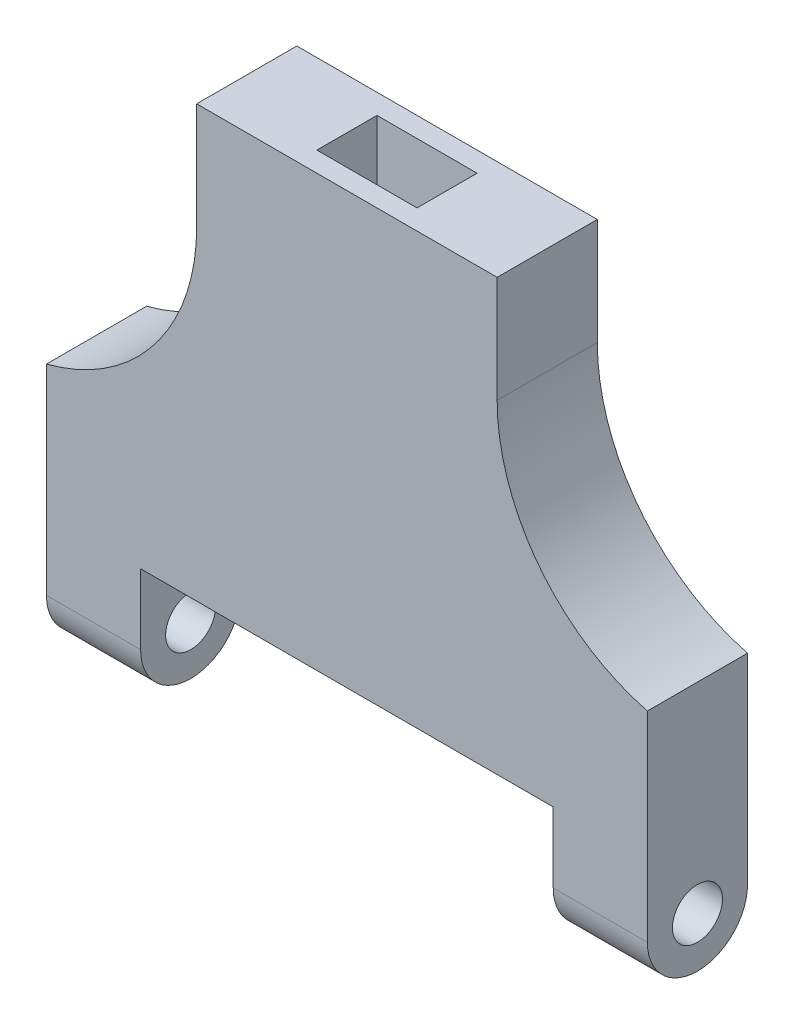
ISO-10303-21;
HEADER;
FILE_DESCRIPTION(('STEP AP214'),'2;1');
FILE_NAME('part.step','',(''),(''),'','','');
FILE_SCHEMA(('AUTOMOTIVE_DESIGN { 1 0 10303 214 1 1 1 1 }'));
ENDSEC;
DATA;
#1=APPLICATION_CONTEXT('core data for automotive mechanical design processes');
#2=APPLICATION_PROTOCOL_DEFINITION('international standard','automotive_design',2000,#1);
#3=PRODUCT_CONTEXT('',#1,'mechanical');
#4=PRODUCT('Part','Part','',(#3));
#5=PRODUCT_RELATED_PRODUCT_CATEGORY('part','',(#4));
#6=PRODUCT_DEFINITION_FORMATION('','',#4);
#7=PRODUCT_DEFINITION_CONTEXT('part definition',#1,'design');
#8=PRODUCT_DEFINITION('design','',#6,#7);
#9=PRODUCT_DEFINITION_SHAPE('','',#8);
#10=(LENGTH_UNIT() NAMED_UNIT(*) SI_UNIT(.MILLI.,.METRE.));
#11=(NAMED_UNIT(*) PLANE_ANGLE_UNIT() SI_UNIT($,.RADIAN.));
#12=(NAMED_UNIT(*) SI_UNIT($,.STERADIAN.) SOLID_ANGLE_UNIT());
#13=UNCERTAINTY_MEASURE_WITH_UNIT(LENGTH_MEASURE(1.E-05),#10,'distance_accuracy_value','');
#14=(GEOMETRIC_REPRESENTATION_CONTEXT(3) GLOBAL_UNCERTAINTY_ASSIGNED_CONTEXT((#13)) GLOBAL_UNIT_ASSIGNED_CONTEXT((#10,
#11,#12)) REPRESENTATION_CONTEXT('',''));
#15=CARTESIAN_POINT('',(0.,0.,0.));
#16=DIRECTION('',(0.,0.,1.));
#17=DIRECTION('',(1.,0.,0.));
#18=AXIS2_PLACEMENT_3D('',#15,#16,#17);
#19=CARTESIAN_POINT('',(-7.07106781186548,60.,2.5));
#20=DIRECTION('',(1.,0.,0.));
#21=DIRECTION('',(0.,0.,-1.));
#22=AXIS2_PLACEMENT_3D('',#19,#20,#21);
#23=CYLINDRICAL_SURFACE('',#22,1.25);
#24=CARTESIAN_POINT('',(0.,60.,2.5));
#25=DIRECTION('',(-1.,0.,0.));
#26=DIRECTION('',(0.,0.,1.));
#27=AXIS2_PLACEMENT_3D('',#24,#25,#26);
#28=CIRCLE('',#27,1.25);
#29=CARTESIAN_POINT('',(0.,60.,3.75));
#30=VERTEX_POINT('',#29);
#31=EDGE_CURVE('E203',#30,#30,#28,.F.);
#32=ORIENTED_EDGE('',*,*,#31,.T.);
#33=EDGE_LOOP('',(#32));
#34=FACE_BOUND('',#33,.T.);
#35=CARTESIAN_POINT('',(-4.7,60.,2.5));
#36=DIRECTION('',(1.,0.,0.));
#37=DIRECTION('',(0.,1.,0.));
#38=AXIS2_PLACEMENT_3D('',#35,#36,#37);
#39=CIRCLE('',#38,1.25);
#40=CARTESIAN_POINT('',(-4.7,61.25,2.5));
#41=VERTEX_POINT('',#40);
#42=EDGE_CURVE('E233',#41,#41,#39,.F.);
#43=ORIENTED_EDGE('',*,*,#42,.T.);
#44=EDGE_LOOP('',(#43));
#45=FACE_BOUND('',#44,.T.);
#46=ADVANCED_FACE('F33',(#34,#45),#23,.F.);
#47=CARTESIAN_POINT('',(-30.,60.,2.5));
#48=DIRECTION('',(1.,0.,0.));
#49=DIRECTION('',(0.,0.,-1.));
#50=AXIS2_PLACEMENT_3D('',#47,#48,#49);
#51=CYLINDRICAL_SURFACE('',#50,2.5);
#52=DIRECTION('',(1.,0.,0.));
#53=VECTOR('',#52,1.);
#54=CARTESIAN_POINT('',(-30.,60.,5.));
#55=LINE('',#54,#53);
#56=CARTESIAN_POINT('',(-4.7,60.,5.));
#57=VERTEX_POINT('',#56);
#58=CARTESIAN_POINT('',(0.,60.,5.));
#59=VERTEX_POINT('',#58);
#60=EDGE_CURVE('E264',#57,#59,#55,.T.);
#61=ORIENTED_EDGE('',*,*,#60,.F.);
#62=CARTESIAN_POINT('',(-4.7,60.,2.5));
#63=DIRECTION('',(1.,0.,0.));
#64=DIRECTION('',(0.,1.,0.));
#65=AXIS2_PLACEMENT_3D('',#62,#63,#64);
#66=CIRCLE('',#65,2.5);
#67=CARTESIAN_POINT('',(-4.7,60.,0.));
#68=VERTEX_POINT('',#67);
#69=EDGE_CURVE('E230',#57,#68,#66,.T.);
#70=ORIENTED_EDGE('',*,*,#69,.T.);
#71=DIRECTION('',(1.,0.,0.));
#72=VECTOR('',#71,1.);
#73=CARTESIAN_POINT('',(-30.,60.,0.));
#74=LINE('',#73,#72);
#75=CARTESIAN_POINT('',(0.,60.,0.));
#76=VERTEX_POINT('',#75);
#77=EDGE_CURVE('E252',#68,#76,#74,.T.);
#78=ORIENTED_EDGE('',*,*,#77,.T.);
#79=CARTESIAN_POINT('',(0.,60.,2.5));
#80=DIRECTION('',(-1.,0.,0.));
#81=DIRECTION('',(0.,0.,1.));
#82=AXIS2_PLACEMENT_3D('',#79,#80,#81);
#83=CIRCLE('',#82,2.5);
#84=EDGE_CURVE('E239',#76,#59,#83,.T.);
#85=ORIENTED_EDGE('',*,*,#84,.T.);
#86=EDGE_LOOP('',(#61,#70,#78,#85));
#87=FACE_BOUND('',#86,.T.);
#88=ADVANCED_FACE('F334',(#87),#51,.T.);
#89=CARTESIAN_POINT('',(-25.3,60.,2.5));
#90=DIRECTION('',(-1.,0.,0.));
#91=DIRECTION('',(0.,-1.,0.));
#92=AXIS2_PLACEMENT_3D('',#89,#90,#91);
#93=CIRCLE('',#92,1.25);
#94=CARTESIAN_POINT('',(-25.3,58.75,2.5));
#95=VERTEX_POINT('',#94);
#96=EDGE_CURVE('E221',#95,#95,#93,.F.);
#97=ORIENTED_EDGE('',*,*,#96,.T.);
#98=EDGE_LOOP('',(#97));
#99=FACE_BOUND('',#98,.T.);
#100=CARTESIAN_POINT('',(-30.,60.,2.5));
#101=DIRECTION('',(-1.,0.,0.));
#102=DIRECTION('',(0.,0.,1.));
#103=AXIS2_PLACEMENT_3D('',#100,#101,#102);
#104=CIRCLE('',#103,1.25);
#105=CARTESIAN_POINT('',(-30.,60.,3.75));
#106=VERTEX_POINT('',#105);
#107=EDGE_CURVE('E236',#106,#106,#104,.T.);
#108=ORIENTED_EDGE('',*,*,#107,.T.);
#109=EDGE_LOOP('',(#108));
#110=FACE_BOUND('',#109,.T.);
#111=ADVANCED_FACE('F336',(#99,#110),#23,.F.);
#112=CARTESIAN_POINT('',(0.,60.,2.5));
#113=DIRECTION('',(-1.,0.,0.));
#114=DIRECTION('',(0.,0.,1.));
#115=AXIS2_PLACEMENT_3D('',#112,#113,#114);
#116=PLANE('',#115);
#117=DIRECTION('',(0.,1.,0.));
#118=VECTOR('',#117,1.);
#119=CARTESIAN_POINT('',(0.,60.,5.));
#120=LINE('',#119,#118);
#121=CARTESIAN_POINT('',(0.,70.,5.));
#122=VERTEX_POINT('',#121);
#123=EDGE_CURVE('E255',#59,#122,#120,.T.);
#124=ORIENTED_EDGE('',*,*,#123,.F.);
#125=ORIENTED_EDGE('',*,*,#84,.F.);
#126=DIRECTION('',(0.,-1.,0.));
#127=VECTOR('',#126,1.);
#128=CARTESIAN_POINT('',(0.,60.,0.));
#129=LINE('',#128,#127);
#130=CARTESIAN_POINT('',(0.,70.,0.));
#131=VERTEX_POINT('',#130);
#132=EDGE_CURVE('E244',#131,#76,#129,.T.);
#133=ORIENTED_EDGE('',*,*,#132,.F.);
#134=DIRECTION('',(0.,0.,-1.));
#135=VECTOR('',#134,1.);
#136=CARTESIAN_POINT('',(0.,70.,5.));
#137=LINE('',#136,#135);
#138=EDGE_CURVE('E257',#122,#131,#137,.T.);
#139=ORIENTED_EDGE('',*,*,#138,.F.);
#140=EDGE_LOOP('',(#124,#125,#133,#139));
#141=FACE_BOUND('',#140,.T.);
#142=ORIENTED_EDGE('',*,*,#31,.F.);
#143=EDGE_LOOP('',(#142));
#144=FACE_BOUND('',#143,.T.);
#145=ADVANCED_FACE('F286',(#141,#144),#116,.F.);
#146=CARTESIAN_POINT('',(-30.,60.,2.5));
#147=DIRECTION('',(-1.,0.,0.));
#148=DIRECTION('',(0.,0.,1.));
#149=AXIS2_PLACEMENT_3D('',#146,#147,#148);
#150=PLANE('',#149);
#151=CARTESIAN_POINT('',(-30.,60.,2.5));
#152=DIRECTION('',(-1.,0.,0.));
#153=DIRECTION('',(0.,0.,1.));
#154=AXIS2_PLACEMENT_3D('',#151,#152,#153);
#155=CIRCLE('',#154,2.5);
#156=CARTESIAN_POINT('',(-30.,60.,0.));
#157=VERTEX_POINT('',#156);
#158=CARTESIAN_POINT('',(-30.,60.,5.));
#159=VERTEX_POINT('',#158);
#160=EDGE_CURVE('E240',#157,#159,#155,.T.);
#161=ORIENTED_EDGE('',*,*,#160,.T.);
#162=DIRECTION('',(0.,1.,0.));
#163=VECTOR('',#162,1.);
#164=CARTESIAN_POINT('',(-30.,60.,5.));
#165=LINE('',#164,#163);
#166=CARTESIAN_POINT('',(-30.,70.,5.));
#167=VERTEX_POINT('',#166);
#168=EDGE_CURVE('E243',#159,#167,#165,.T.);
#169=ORIENTED_EDGE('',*,*,#168,.T.);
#170=DIRECTION('',(0.,0.,-1.));
#171=VECTOR('',#170,1.);
#172=CARTESIAN_POINT('',(-30.,70.,5.));
#173=LINE('',#172,#171);
#174=CARTESIAN_POINT('',(-30.,70.,0.));
#175=VERTEX_POINT('',#174);
#176=EDGE_CURVE('E247',#167,#175,#173,.T.);
#177=ORIENTED_EDGE('',*,*,#176,.T.);
#178=DIRECTION('',(0.,-1.,0.));
#179=VECTOR('',#178,1.);
#180=CARTESIAN_POINT('',(-30.,60.,0.));
#181=LINE('',#180,#179);
#182=EDGE_CURVE('E250',#175,#157,#181,.T.);
#183=ORIENTED_EDGE('',*,*,#182,.T.);
#184=EDGE_LOOP('',(#161,#169,#177,#183));
#185=FACE_BOUND('',#184,.T.);
#186=ORIENTED_EDGE('',*,*,#107,.F.);
#187=EDGE_LOOP('',(#186));
#188=FACE_BOUND('',#187,.T.);
#189=ADVANCED_FACE('F311',(#185,#188),#150,.T.);
#190=CARTESIAN_POINT('',(-25.3,60.,0.));
#191=VERTEX_POINT('',#190);
#192=EDGE_CURVE('E261',#157,#191,#74,.T.);
#193=ORIENTED_EDGE('',*,*,#192,.T.);
#194=CARTESIAN_POINT('',(-25.3,60.,2.5));
#195=DIRECTION('',(-1.,0.,0.));
#196=DIRECTION('',(0.,-1.,0.));
#197=AXIS2_PLACEMENT_3D('',#194,#195,#196);
#198=CIRCLE('',#197,2.5);
#199=CARTESIAN_POINT('',(-25.3,60.,5.));
#200=VERTEX_POINT('',#199);
#201=EDGE_CURVE('E218',#191,#200,#198,.T.);
#202=ORIENTED_EDGE('',*,*,#201,.T.);
#203=EDGE_CURVE('E265',#159,#200,#55,.T.);
#204=ORIENTED_EDGE('',*,*,#203,.F.);
#205=ORIENTED_EDGE('',*,*,#160,.F.);
#206=EDGE_LOOP('',(#193,#202,#204,#205));
#207=FACE_BOUND('',#206,.T.);
#208=ADVANCED_FACE('F318',(#207),#51,.T.);
#209=CARTESIAN_POINT('',(-30.,60.,5.));
#210=DIRECTION('',(0.,0.,-1.));
#211=DIRECTION('',(-1.,0.,0.));
#212=AXIS2_PLACEMENT_3D('',#209,#210,#211);
#213=PLANE('',#212);
#214=DIRECTION('',(1.,0.,0.));
#215=VECTOR('',#214,1.);
#216=CARTESIAN_POINT('',(-30.,63.5,5.));
#217=LINE('',#216,#215);
#218=CARTESIAN_POINT('',(-25.3,63.5,5.));
#219=VERTEX_POINT('',#218);
#220=CARTESIAN_POINT('',(-4.7,63.5,5.));
#221=VERTEX_POINT('',#220);
#222=EDGE_CURVE('E224',#219,#221,#217,.T.);
#223=ORIENTED_EDGE('',*,*,#222,.T.);
#224=DIRECTION('',(0.,-1.,0.));
#225=VECTOR('',#224,1.);
#226=CARTESIAN_POINT('',(-4.7,60.,5.));
#227=LINE('',#226,#225);
#228=EDGE_CURVE('E227',#221,#57,#227,.T.);
#229=ORIENTED_EDGE('',*,*,#228,.T.);
#230=ORIENTED_EDGE('',*,*,#60,.T.);
#231=ORIENTED_EDGE('',*,*,#123,.T.);
#232=CARTESIAN_POINT('',(2.5,79.6824583655185,5.));
#233=DIRECTION('',(0.,0.,-1.));
#234=DIRECTION('',(-1.,0.,0.));
#235=AXIS2_PLACEMENT_3D('',#232,#233,#234);
#236=CIRCLE('',#235,10.);
#237=CARTESIAN_POINT('',(-7.5,79.6824583655185,5.));
#238=VERTEX_POINT('',#237);
#239=EDGE_CURVE('E11',#122,#238,#236,.T.);
#240=ORIENTED_EDGE('',*,*,#239,.T.);
#241=DIRECTION('',(0.,1.,0.));
#242=VECTOR('',#241,1.);
#243=CARTESIAN_POINT('',(-7.5,70.,5.));
#244=LINE('',#243,#242);
#245=CARTESIAN_POINT('',(-7.5,85.,5.));
#246=VERTEX_POINT('',#245);
#247=EDGE_CURVE('E184',#238,#246,#244,.T.);
#248=ORIENTED_EDGE('',*,*,#247,.T.);
#249=DIRECTION('',(-1.,0.,0.));
#250=VECTOR('',#249,1.);
#251=CARTESIAN_POINT('',(-22.5,85.,5.));
#252=LINE('',#251,#250);
#253=CARTESIAN_POINT('',(-22.5,85.,5.));
#254=VERTEX_POINT('',#253);
#255=EDGE_CURVE('E190',#246,#254,#252,.T.);
#256=ORIENTED_EDGE('',*,*,#255,.T.);
#257=DIRECTION('',(0.,-1.,0.));
#258=VECTOR('',#257,1.);
#259=CARTESIAN_POINT('',(-22.5,70.,5.));
#260=LINE('',#259,#258);
#261=CARTESIAN_POINT('',(-22.5,79.6824583655185,5.));
#262=VERTEX_POINT('',#261);
#263=EDGE_CURVE('E186',#254,#262,#260,.T.);
#264=ORIENTED_EDGE('',*,*,#263,.T.);
#265=CARTESIAN_POINT('',(-32.5,79.6824583655185,5.));
#266=DIRECTION('',(0.,0.,-1.));
#267=DIRECTION('',(-1.,0.,0.));
#268=AXIS2_PLACEMENT_3D('',#265,#266,#267);
#269=CIRCLE('',#268,10.);
#270=EDGE_CURVE('E277',#262,#167,#269,.T.);
#271=ORIENTED_EDGE('',*,*,#270,.T.);
#272=ORIENTED_EDGE('',*,*,#168,.F.);
#273=ORIENTED_EDGE('',*,*,#203,.T.);
#274=DIRECTION('',(0.,1.,0.));
#275=VECTOR('',#274,1.);
#276=CARTESIAN_POINT('',(-25.3,60.,5.));
#277=LINE('',#276,#275);
#278=EDGE_CURVE('E214',#200,#219,#277,.T.);
#279=ORIENTED_EDGE('',*,*,#278,.T.);
#280=EDGE_LOOP('',(#223,#229,#230,#231,#240,#248,#256,#264,#271,#272,#273,#279));
#281=FACE_BOUND('',#280,.T.);
#282=ADVANCED_FACE('F292',(#281),#213,.F.);
#283=CARTESIAN_POINT('',(-30.,60.,0.));
#284=DIRECTION('',(0.,0.,1.));
#285=DIRECTION('',(0.,-1.,0.));
#286=AXIS2_PLACEMENT_3D('',#283,#284,#285);
#287=PLANE('',#286);
#288=ORIENTED_EDGE('',*,*,#77,.F.);
#289=DIRECTION('',(0.,-1.,0.));
#290=VECTOR('',#289,1.);
#291=CARTESIAN_POINT('',(-4.7,63.5,0.));
#292=LINE('',#291,#290);
#293=CARTESIAN_POINT('',(-4.7,63.5,0.));
#294=VERTEX_POINT('',#293);
#295=EDGE_CURVE('E206',#294,#68,#292,.T.);
#296=ORIENTED_EDGE('',*,*,#295,.F.);
#297=DIRECTION('',(1.,0.,0.));
#298=VECTOR('',#297,1.);
#299=CARTESIAN_POINT('',(-4.7,63.5,0.));
#300=LINE('',#299,#298);
#301=CARTESIAN_POINT('',(-25.3,63.5,0.));
#302=VERTEX_POINT('',#301);
#303=EDGE_CURVE('E208',#302,#294,#300,.T.);
#304=ORIENTED_EDGE('',*,*,#303,.F.);
#305=DIRECTION('',(0.,-1.,0.));
#306=VECTOR('',#305,1.);
#307=CARTESIAN_POINT('',(-25.3,60.,0.));
#308=LINE('',#307,#306);
#309=EDGE_CURVE('E268',#302,#191,#308,.T.);
#310=ORIENTED_EDGE('',*,*,#309,.T.);
#311=ORIENTED_EDGE('',*,*,#192,.F.);
#312=ORIENTED_EDGE('',*,*,#182,.F.);
#313=CARTESIAN_POINT('',(-32.5,79.6824583655185,0.));
#314=DIRECTION('',(0.,0.,1.));
#315=DIRECTION('',(0.,-1.,0.));
#316=AXIS2_PLACEMENT_3D('',#313,#314,#315);
#317=CIRCLE('',#316,10.);
#318=CARTESIAN_POINT('',(-22.5,79.6824583655185,0.));
#319=VERTEX_POINT('',#318);
#320=EDGE_CURVE('E275',#175,#319,#317,.T.);
#321=ORIENTED_EDGE('',*,*,#320,.T.);
#322=DIRECTION('',(0.,1.,0.));
#323=VECTOR('',#322,1.);
#324=CARTESIAN_POINT('',(-22.5,70.,0.));
#325=LINE('',#324,#323);
#326=CARTESIAN_POINT('',(-22.5,85.,0.));
#327=VERTEX_POINT('',#326);
#328=EDGE_CURVE('E180',#319,#327,#325,.T.);
#329=ORIENTED_EDGE('',*,*,#328,.T.);
#330=DIRECTION('',(1.,0.,0.));
#331=VECTOR('',#330,1.);
#332=CARTESIAN_POINT('',(-22.5,85.,0.));
#333=LINE('',#332,#331);
#334=CARTESIAN_POINT('',(-7.5,85.,0.));
#335=VERTEX_POINT('',#334);
#336=EDGE_CURVE('E192',#327,#335,#333,.T.);
#337=ORIENTED_EDGE('',*,*,#336,.T.);
#338=DIRECTION('',(0.,-1.,0.));
#339=VECTOR('',#338,1.);
#340=CARTESIAN_POINT('',(-7.5,70.,0.));
#341=LINE('',#340,#339);
#342=CARTESIAN_POINT('',(-7.5,79.6824583655185,0.));
#343=VERTEX_POINT('',#342);
#344=EDGE_CURVE('E195',#335,#343,#341,.T.);
#345=ORIENTED_EDGE('',*,*,#344,.T.);
#346=CARTESIAN_POINT('',(2.5,79.6824583655185,0.));
#347=DIRECTION('',(0.,0.,1.));
#348=DIRECTION('',(0.,-1.,0.));
#349=AXIS2_PLACEMENT_3D('',#346,#347,#348);
#350=CIRCLE('',#349,10.);
#351=EDGE_CURVE('E41',#343,#131,#350,.T.);
#352=ORIENTED_EDGE('',*,*,#351,.T.);
#353=ORIENTED_EDGE('',*,*,#132,.T.);
#354=EDGE_LOOP('',(#288,#296,#304,#310,#311,#312,#321,#329,#337,#345,#352,#353));
#355=FACE_BOUND('',#354,.T.);
#356=ADVANCED_FACE('F281',(#355),#287,.F.);
#357=CARTESIAN_POINT('',(-4.7,63.5,30.));
#358=DIRECTION('',(1.,0.,0.));
#359=DIRECTION('',(0.,1.,0.));
#360=AXIS2_PLACEMENT_3D('',#357,#358,#359);
#361=PLANE('',#360);
#362=ORIENTED_EDGE('',*,*,#228,.F.);
#363=DIRECTION('',(0.,0.,-1.));
#364=VECTOR('',#363,1.);
#365=CARTESIAN_POINT('',(-4.7,63.5,30.));
#366=LINE('',#365,#364);
#367=EDGE_CURVE('E212',#221,#294,#366,.T.);
#368=ORIENTED_EDGE('',*,*,#367,.T.);
#369=ORIENTED_EDGE('',*,*,#295,.T.);
#370=ORIENTED_EDGE('',*,*,#69,.F.);
#371=EDGE_LOOP('',(#362,#368,#369,#370));
#372=FACE_BOUND('',#371,.T.);
#373=ORIENTED_EDGE('',*,*,#42,.F.);
#374=EDGE_LOOP('',(#373));
#375=FACE_BOUND('',#374,.T.);
#376=ADVANCED_FACE('F330',(#372,#375),#361,.F.);
#377=CARTESIAN_POINT('',(-4.7,63.5,30.));
#378=DIRECTION('',(0.,1.,0.));
#379=DIRECTION('',(0.,0.,1.));
#380=AXIS2_PLACEMENT_3D('',#377,#378,#379);
#381=PLANE('',#380);
#382=DIRECTION('',(0.,0.,-1.));
#383=VECTOR('',#382,1.);
#384=CARTESIAN_POINT('',(-25.3,63.5,30.));
#385=LINE('',#384,#383);
#386=EDGE_CURVE('E211',#219,#302,#385,.T.);
#387=ORIENTED_EDGE('',*,*,#386,.T.);
#388=ORIENTED_EDGE('',*,*,#303,.T.);
#389=ORIENTED_EDGE('',*,*,#367,.F.);
#390=ORIENTED_EDGE('',*,*,#222,.F.);
#391=EDGE_LOOP('',(#387,#388,#389,#390));
#392=FACE_BOUND('',#391,.T.);
#393=ADVANCED_FACE('F326',(#392),#381,.F.);
#394=CARTESIAN_POINT('',(-25.3,63.5,30.));
#395=DIRECTION('',(-1.,0.,0.));
#396=DIRECTION('',(0.,-1.,0.));
#397=AXIS2_PLACEMENT_3D('',#394,#395,#396);
#398=PLANE('',#397);
#399=ORIENTED_EDGE('',*,*,#309,.F.);
#400=ORIENTED_EDGE('',*,*,#386,.F.);
#401=ORIENTED_EDGE('',*,*,#278,.F.);
#402=ORIENTED_EDGE('',*,*,#201,.F.);
#403=EDGE_LOOP('',(#399,#400,#401,#402));
#404=FACE_BOUND('',#403,.T.);
#405=ORIENTED_EDGE('',*,*,#96,.F.);
#406=EDGE_LOOP('',(#405));
#407=FACE_BOUND('',#406,.T.);
#408=ADVANCED_FACE('F322',(#404,#407),#398,.F.);
#409=CARTESIAN_POINT('',(-22.5,70.,26.2132034355964));
#410=DIRECTION('',(-1.,0.,0.));
#411=DIRECTION('',(0.,0.,1.));
#412=AXIS2_PLACEMENT_3D('',#409,#410,#411);
#413=PLANE('',#412);
#414=ORIENTED_EDGE('',*,*,#328,.F.);
#415=DIRECTION('',(0.,0.,1.));
#416=VECTOR('',#415,1.);
#417=CARTESIAN_POINT('',(-22.5,79.6824583655185,5.));
#418=LINE('',#417,#416);
#419=EDGE_CURVE('E271',#319,#262,#418,.T.);
#420=ORIENTED_EDGE('',*,*,#419,.T.);
#421=ORIENTED_EDGE('',*,*,#263,.F.);
#422=DIRECTION('',(0.,0.,-1.));
#423=VECTOR('',#422,1.);
#424=CARTESIAN_POINT('',(-22.5,85.,26.2132034355964));
#425=LINE('',#424,#423);
#426=EDGE_CURVE('E198',#254,#327,#425,.T.);
#427=ORIENTED_EDGE('',*,*,#426,.T.);
#428=EDGE_LOOP('',(#414,#420,#421,#427));
#429=FACE_BOUND('',#428,.T.);
#430=ADVANCED_FACE('F305',(#429),#413,.T.);
#431=CARTESIAN_POINT('',(-7.5,70.,26.2132034355964));
#432=DIRECTION('',(1.,0.,0.));
#433=DIRECTION('',(0.,0.,-1.));
#434=AXIS2_PLACEMENT_3D('',#431,#432,#433);
#435=PLANE('',#434);
#436=ORIENTED_EDGE('',*,*,#247,.F.);
#437=DIRECTION('',(0.,0.,1.));
#438=VECTOR('',#437,1.);
#439=CARTESIAN_POINT('',(-7.5,79.6824583655185,0.));
#440=LINE('',#439,#438);
#441=EDGE_CURVE('E273',#238,#343,#440,.F.);
#442=ORIENTED_EDGE('',*,*,#441,.T.);
#443=ORIENTED_EDGE('',*,*,#344,.F.);
#444=DIRECTION('',(0.,0.,-1.));
#445=VECTOR('',#444,1.);
#446=CARTESIAN_POINT('',(-7.5,85.,26.2132034355964));
#447=LINE('',#446,#445);
#448=EDGE_CURVE('E187',#246,#335,#447,.T.);
#449=ORIENTED_EDGE('',*,*,#448,.F.);
#450=EDGE_LOOP('',(#436,#442,#443,#449));
#451=FACE_BOUND('',#450,.T.);
#452=ADVANCED_FACE('F295',(#451),#435,.T.);
#453=CARTESIAN_POINT('',(-22.5,85.,26.2132034355964));
#454=DIRECTION('',(0.,1.,0.));
#455=DIRECTION('',(0.,0.,1.));
#456=AXIS2_PLACEMENT_3D('',#453,#454,#455);
#457=PLANE('',#456);
#458=DIRECTION('',(0.,0.,-1.));
#459=VECTOR('',#458,1.);
#460=CARTESIAN_POINT('',(-12.5,85.,4.00000000000001));
#461=LINE('',#460,#459);
#462=CARTESIAN_POINT('',(-12.5,85.,4.00000000000001));
#463=VERTEX_POINT('',#462);
#464=CARTESIAN_POINT('',(-12.5,85.,1.00000000000001));
#465=VERTEX_POINT('',#464);
#466=EDGE_CURVE('E48',#463,#465,#461,.T.);
#467=ORIENTED_EDGE('',*,*,#466,.F.);
#468=DIRECTION('',(1.,0.,0.));
#469=VECTOR('',#468,1.);
#470=CARTESIAN_POINT('',(-12.5,85.,4.00000000000001));
#471=LINE('',#470,#469);
#472=CARTESIAN_POINT('',(-17.5,85.,4.00000000000001));
#473=VERTEX_POINT('',#472);
#474=EDGE_CURVE('E165',#473,#463,#471,.T.);
#475=ORIENTED_EDGE('',*,*,#474,.F.);
#476=DIRECTION('',(0.,0.,1.));
#477=VECTOR('',#476,1.);
#478=CARTESIAN_POINT('',(-17.5,85.,4.00000000000001));
#479=LINE('',#478,#477);
#480=CARTESIAN_POINT('',(-17.5,85.,1.00000000000001));
#481=VERTEX_POINT('',#480);
#482=EDGE_CURVE('E168',#481,#473,#479,.T.);
#483=ORIENTED_EDGE('',*,*,#482,.F.);
#484=DIRECTION('',(-1.,0.,0.));
#485=VECTOR('',#484,1.);
#486=CARTESIAN_POINT('',(-12.5,85.,1.00000000000001));
#487=LINE('',#486,#485);
#488=EDGE_CURVE('E174',#465,#481,#487,.T.);
#489=ORIENTED_EDGE('',*,*,#488,.F.);
#490=EDGE_LOOP('',(#467,#475,#483,#489));
#491=FACE_BOUND('',#490,.T.);
#492=ORIENTED_EDGE('',*,*,#255,.F.);
#493=ORIENTED_EDGE('',*,*,#448,.T.);
#494=ORIENTED_EDGE('',*,*,#336,.F.);
#495=ORIENTED_EDGE('',*,*,#426,.F.);
#496=EDGE_LOOP('',(#492,#493,#494,#495));
#497=FACE_BOUND('',#496,.T.);
#498=ADVANCED_FACE('F300',(#491,#497),#457,.T.);
#499=CARTESIAN_POINT('',(-32.5,79.6824583655185,5.));
#500=DIRECTION('',(0.,0.,-1.));
#501=DIRECTION('',(-1.,0.,0.));
#502=AXIS2_PLACEMENT_3D('',#499,#500,#501);
#503=CYLINDRICAL_SURFACE('',#502,10.);
#504=ORIENTED_EDGE('',*,*,#270,.F.);
#505=ORIENTED_EDGE('',*,*,#419,.F.);
#506=ORIENTED_EDGE('',*,*,#320,.F.);
#507=ORIENTED_EDGE('',*,*,#176,.F.);
#508=EDGE_LOOP('',(#504,#505,#506,#507));
#509=FACE_BOUND('',#508,.T.);
#510=ADVANCED_FACE('F308',(#509),#503,.F.);
#511=CARTESIAN_POINT('',(2.5,79.6824583655185,5.));
#512=DIRECTION('',(0.,0.,-1.));
#513=DIRECTION('',(-1.,0.,0.));
#514=AXIS2_PLACEMENT_3D('',#511,#512,#513);
#515=CYLINDRICAL_SURFACE('',#514,10.);
#516=ORIENTED_EDGE('',*,*,#239,.F.);
#517=ORIENTED_EDGE('',*,*,#138,.T.);
#518=ORIENTED_EDGE('',*,*,#351,.F.);
#519=ORIENTED_EDGE('',*,*,#441,.F.);
#520=EDGE_LOOP('',(#516,#517,#518,#519));
#521=FACE_BOUND('',#520,.T.);
#522=ADVANCED_FACE('F35',(#521),#515,.F.);
#523=CARTESIAN_POINT('',(-12.5,71.,4.00000000000001));
#524=DIRECTION('',(1.,0.,0.));
#525=DIRECTION('',(0.,0.,-1.));
#526=AXIS2_PLACEMENT_3D('',#523,#524,#525);
#527=PLANE('',#526);
#528=ORIENTED_EDGE('',*,*,#466,.T.);
#529=DIRECTION('',(0.,1.,0.));
#530=VECTOR('',#529,1.);
#531=CARTESIAN_POINT('',(-12.5,71.,1.));
#532=LINE('',#531,#530);
#533=CARTESIAN_POINT('',(-12.5,71.,1.));
#534=VERTEX_POINT('',#533);
#535=EDGE_CURVE('E143',#534,#465,#532,.T.);
#536=ORIENTED_EDGE('',*,*,#535,.F.);
#537=DIRECTION('',(0.,0.,-1.));
#538=VECTOR('',#537,1.);
#539=CARTESIAN_POINT('',(-12.5,71.,4.00000000000001));
#540=LINE('',#539,#538);
#541=CARTESIAN_POINT('',(-12.5,71.,4.00000000000001));
#542=VERTEX_POINT('',#541);
#543=EDGE_CURVE('E147',#542,#534,#540,.T.);
#544=ORIENTED_EDGE('',*,*,#543,.F.);
#545=DIRECTION('',(0.,1.,0.));
#546=VECTOR('',#545,1.);
#547=CARTESIAN_POINT('',(-12.5,71.,4.00000000000001));
#548=LINE('',#547,#546);
#549=EDGE_CURVE('E178',#542,#463,#548,.T.);
#550=ORIENTED_EDGE('',*,*,#549,.T.);
#551=EDGE_LOOP('',(#528,#536,#544,#550));
#552=FACE_BOUND('',#551,.T.);
#553=ADVANCED_FACE('F145',(#552),#527,.F.);
#554=CARTESIAN_POINT('',(-12.5,71.,4.00000000000001));
#555=DIRECTION('',(0.,0.,1.));
#556=DIRECTION('',(0.,-1.,0.));
#557=AXIS2_PLACEMENT_3D('',#554,#555,#556);
#558=PLANE('',#557);
#559=ORIENTED_EDGE('',*,*,#474,.T.);
#560=ORIENTED_EDGE('',*,*,#549,.F.);
#561=DIRECTION('',(1.,0.,0.));
#562=VECTOR('',#561,1.);
#563=CARTESIAN_POINT('',(-12.5,71.,4.00000000000001));
#564=LINE('',#563,#562);
#565=CARTESIAN_POINT('',(-17.5,71.,4.00000000000001));
#566=VERTEX_POINT('',#565);
#567=EDGE_CURVE('E153',#566,#542,#564,.T.);
#568=ORIENTED_EDGE('',*,*,#567,.F.);
#569=DIRECTION('',(0.,1.,0.));
#570=VECTOR('',#569,1.);
#571=CARTESIAN_POINT('',(-17.5,71.,4.00000000000001));
#572=LINE('',#571,#570);
#573=EDGE_CURVE('E181',#566,#473,#572,.T.);
#574=ORIENTED_EDGE('',*,*,#573,.T.);
#575=EDGE_LOOP('',(#559,#560,#568,#574));
#576=FACE_BOUND('',#575,.T.);
#577=ADVANCED_FACE('F380',(#576),#558,.F.);
#578=CARTESIAN_POINT('',(-17.5,71.,4.00000000000001));
#579=DIRECTION('',(-1.,0.,0.));
#580=DIRECTION('',(0.,0.,1.));
#581=AXIS2_PLACEMENT_3D('',#578,#579,#580);
#582=PLANE('',#581);
#583=ORIENTED_EDGE('',*,*,#482,.T.);
#584=ORIENTED_EDGE('',*,*,#573,.F.);
#585=DIRECTION('',(0.,0.,1.));
#586=VECTOR('',#585,1.);
#587=CARTESIAN_POINT('',(-17.5,71.,4.00000000000001));
#588=LINE('',#587,#586);
#589=CARTESIAN_POINT('',(-17.5,71.,1.));
#590=VERTEX_POINT('',#589);
#591=EDGE_CURVE('E161',#590,#566,#588,.T.);
#592=ORIENTED_EDGE('',*,*,#591,.F.);
#593=DIRECTION('',(0.,1.,0.));
#594=VECTOR('',#593,1.);
#595=CARTESIAN_POINT('',(-17.5,71.,1.));
#596=LINE('',#595,#594);
#597=EDGE_CURVE('E152',#590,#481,#596,.T.);
#598=ORIENTED_EDGE('',*,*,#597,.T.);
#599=EDGE_LOOP('',(#583,#584,#592,#598));
#600=FACE_BOUND('',#599,.T.);
#601=ADVANCED_FACE('F383',(#600),#582,.F.);
#602=CARTESIAN_POINT('',(-12.5,71.,1.));
#603=DIRECTION('',(0.,0.,-1.));
#604=DIRECTION('',(0.,1.,0.));
#605=AXIS2_PLACEMENT_3D('',#602,#603,#604);
#606=PLANE('',#605);
#607=ORIENTED_EDGE('',*,*,#488,.T.);
#608=ORIENTED_EDGE('',*,*,#597,.F.);
#609=DIRECTION('',(-1.,0.,0.));
#610=VECTOR('',#609,1.);
#611=CARTESIAN_POINT('',(-12.5,71.,1.));
#612=LINE('',#611,#610);
#613=EDGE_CURVE('E156',#534,#590,#612,.T.);
#614=ORIENTED_EDGE('',*,*,#613,.F.);
#615=ORIENTED_EDGE('',*,*,#535,.T.);
#616=EDGE_LOOP('',(#607,#608,#614,#615));
#617=FACE_BOUND('',#616,.T.);
#618=ADVANCED_FACE('F157',(#617),#606,.F.);
#619=CARTESIAN_POINT('',(0.,71.,0.));
#620=DIRECTION('',(0.,1.,0.));
#621=DIRECTION('',(0.,0.,1.));
#622=AXIS2_PLACEMENT_3D('',#619,#620,#621);
#623=PLANE('',#622);
#624=ORIENTED_EDGE('',*,*,#543,.T.);
#625=ORIENTED_EDGE('',*,*,#613,.T.);
#626=ORIENTED_EDGE('',*,*,#591,.T.);
#627=ORIENTED_EDGE('',*,*,#567,.T.);
#628=EDGE_LOOP('',(#624,#625,#626,#627));
#629=FACE_BOUND('',#628,.T.);
#630=ADVANCED_FACE('F163',(#629),#623,.T.);
#631=CLOSED_SHELL('',(#46,#88,#111,#145,#189,#208,#282,#356,#376,#393,#408,#430,#452,#498,#510,
#522,#553,#577,#601,#618,#630));
#632=MANIFOLD_SOLID_BREP('B2',#631);
#633=ADVANCED_BREP_SHAPE_REPRESENTATION('',(#18,#632),#14);
#634=SHAPE_DEFINITION_REPRESENTATION(#9,#633);
ENDSEC;
END-ISO-10303-21;
